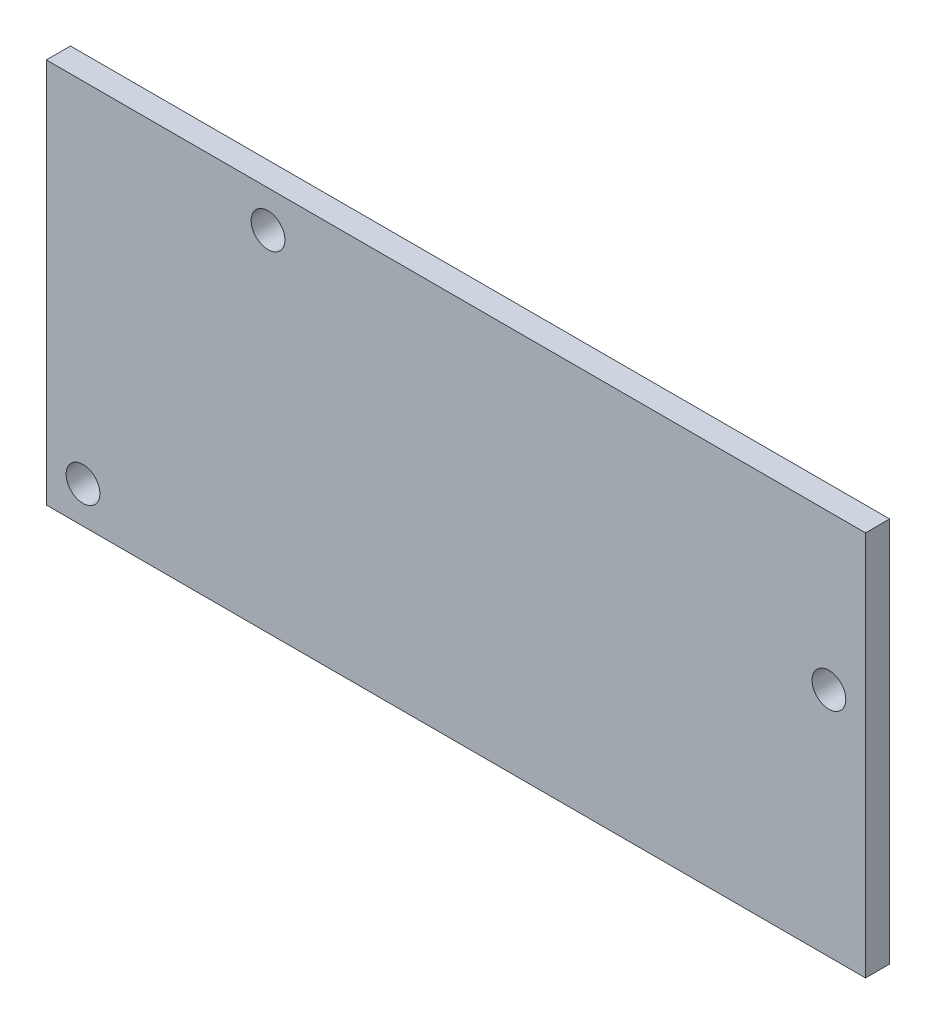
ISO-10303-21;
HEADER;
FILE_DESCRIPTION(('STEP AP214'),'2;1');
FILE_NAME('part.step','',(''),(''),'','','');
FILE_SCHEMA(('AUTOMOTIVE_DESIGN { 1 0 10303 214 1 1 1 1 }'));
ENDSEC;
DATA;
#1=APPLICATION_CONTEXT('core data for automotive mechanical design processes');
#2=APPLICATION_PROTOCOL_DEFINITION('international standard','automotive_design',2000,#1);
#3=PRODUCT_CONTEXT('',#1,'mechanical');
#4=PRODUCT('Part','Part','',(#3));
#5=PRODUCT_RELATED_PRODUCT_CATEGORY('part','',(#4));
#6=PRODUCT_DEFINITION_FORMATION('','',#4);
#7=PRODUCT_DEFINITION_CONTEXT('part definition',#1,'design');
#8=PRODUCT_DEFINITION('design','',#6,#7);
#9=PRODUCT_DEFINITION_SHAPE('','',#8);
#10=(LENGTH_UNIT() NAMED_UNIT(*) SI_UNIT(.MILLI.,.METRE.));
#11=(NAMED_UNIT(*) PLANE_ANGLE_UNIT() SI_UNIT($,.RADIAN.));
#12=(NAMED_UNIT(*) SI_UNIT($,.STERADIAN.) SOLID_ANGLE_UNIT());
#13=UNCERTAINTY_MEASURE_WITH_UNIT(LENGTH_MEASURE(1.E-05),#10,'distance_accuracy_value','');
#14=(GEOMETRIC_REPRESENTATION_CONTEXT(3) GLOBAL_UNCERTAINTY_ASSIGNED_CONTEXT((#13)) GLOBAL_UNIT_ASSIGNED_CONTEXT((#10,
#11,#12)) REPRESENTATION_CONTEXT('',''));
#15=CARTESIAN_POINT('',(0.,0.,0.));
#16=DIRECTION('',(0.,0.,1.));
#17=DIRECTION('',(1.,0.,0.));
#18=AXIS2_PLACEMENT_3D('',#15,#16,#17);
#19=CARTESIAN_POINT('',(0.,0.,0.));
#20=DIRECTION('',(0.,0.,-1.));
#21=DIRECTION('',(-1.,0.,0.));
#22=AXIS2_PLACEMENT_3D('',#19,#20,#21);
#23=PLANE('',#22);
#24=CARTESIAN_POINT('',(3.8,3.8,0.));
#25=DIRECTION('',(0.,0.,1.));
#26=DIRECTION('',(1.,0.,0.));
#27=AXIS2_PLACEMENT_3D('',#24,#25,#26);
#28=CIRCLE('',#27,1.75);
#29=CARTESIAN_POINT('',(5.55,3.8,0.));
#30=VERTEX_POINT('',#29);
#31=EDGE_CURVE('E227',#30,#30,#28,.T.);
#32=ORIENTED_EDGE('',*,*,#31,.T.);
#33=EDGE_LOOP('',(#32));
#34=FACE_BOUND('',#33,.T.);
#35=DIRECTION('',(0.,-1.,0.));
#36=VECTOR('',#35,1.);
#37=CARTESIAN_POINT('',(0.,0.,0.));
#38=LINE('',#37,#36);
#39=CARTESIAN_POINT('',(0.,40.,0.));
#40=VERTEX_POINT('',#39);
#41=CARTESIAN_POINT('',(0.,0.,0.));
#42=VERTEX_POINT('',#41);
#43=EDGE_CURVE('E152',#40,#42,#38,.T.);
#44=ORIENTED_EDGE('',*,*,#43,.F.);
#45=DIRECTION('',(-1.,0.,0.));
#46=VECTOR('',#45,1.);
#47=CARTESIAN_POINT('',(0.,40.,0.));
#48=LINE('',#47,#46);
#49=CARTESIAN_POINT('',(85.,40.,0.));
#50=VERTEX_POINT('',#49);
#51=EDGE_CURVE('E148',#50,#40,#48,.T.);
#52=ORIENTED_EDGE('',*,*,#51,.F.);
#53=DIRECTION('',(0.,1.,0.));
#54=VECTOR('',#53,1.);
#55=CARTESIAN_POINT('',(85.,0.,0.));
#56=LINE('',#55,#54);
#57=CARTESIAN_POINT('',(85.,0.,0.));
#58=VERTEX_POINT('',#57);
#59=EDGE_CURVE('E247',#58,#50,#56,.T.);
#60=ORIENTED_EDGE('',*,*,#59,.F.);
#61=DIRECTION('',(1.,0.,0.));
#62=VECTOR('',#61,1.);
#63=CARTESIAN_POINT('',(0.,0.,0.));
#64=LINE('',#63,#62);
#65=EDGE_CURVE('E245',#42,#58,#64,.T.);
#66=ORIENTED_EDGE('',*,*,#65,.F.);
#67=EDGE_LOOP('',(#44,#52,#60,#66));
#68=FACE_BOUND('',#67,.T.);
#69=CARTESIAN_POINT('',(23.,36.2,0.));
#70=DIRECTION('',(0.,0.,1.));
#71=DIRECTION('',(1.,0.,0.));
#72=AXIS2_PLACEMENT_3D('',#69,#70,#71);
#73=CIRCLE('',#72,1.75);
#74=CARTESIAN_POINT('',(24.75,36.2,0.));
#75=VERTEX_POINT('',#74);
#76=EDGE_CURVE('E233',#75,#75,#73,.T.);
#77=ORIENTED_EDGE('',*,*,#76,.T.);
#78=EDGE_LOOP('',(#77));
#79=FACE_BOUND('',#78,.T.);
#80=CARTESIAN_POINT('',(81.2,24.,0.));
#81=DIRECTION('',(0.,0.,1.));
#82=DIRECTION('',(1.,0.,0.));
#83=AXIS2_PLACEMENT_3D('',#80,#81,#82);
#84=CIRCLE('',#83,1.75);
#85=CARTESIAN_POINT('',(82.95,24.,0.));
#86=VERTEX_POINT('',#85);
#87=EDGE_CURVE('E223',#86,#86,#84,.T.);
#88=ORIENTED_EDGE('',*,*,#87,.T.);
#89=EDGE_LOOP('',(#88));
#90=FACE_BOUND('',#89,.T.);
#91=DIRECTION('',(0.,1.,0.));
#92=VECTOR('',#91,1.);
#93=CARTESIAN_POINT('',(55.,28.5,0.));
#94=LINE('',#93,#92);
#95=CARTESIAN_POINT('',(55.,9.,0.));
#96=VERTEX_POINT('',#95);
#97=CARTESIAN_POINT('',(55.,31.,0.));
#98=VERTEX_POINT('',#97);
#99=EDGE_CURVE('E203',#96,#98,#94,.T.);
#100=ORIENTED_EDGE('',*,*,#99,.F.);
#101=DIRECTION('',(-1.,0.,0.));
#102=VECTOR('',#101,1.);
#103=CARTESIAN_POINT('',(0.,9.,0.));
#104=LINE('',#103,#102);
#105=CARTESIAN_POINT('',(58.,9.,0.));
#106=VERTEX_POINT('',#105);
#107=EDGE_CURVE('E174',#96,#106,#104,.F.);
#108=ORIENTED_EDGE('',*,*,#107,.T.);
#109=DIRECTION('',(0.,-1.,0.));
#110=VECTOR('',#109,1.);
#111=CARTESIAN_POINT('',(58.,28.5,0.));
#112=LINE('',#111,#110);
#113=CARTESIAN_POINT('',(58.,31.,0.));
#114=VERTEX_POINT('',#113);
#115=EDGE_CURVE('E167',#114,#106,#112,.T.);
#116=ORIENTED_EDGE('',*,*,#115,.F.);
#117=DIRECTION('',(1.,0.,0.));
#118=VECTOR('',#117,1.);
#119=CARTESIAN_POINT('',(0.,31.,0.));
#120=LINE('',#119,#118);
#121=EDGE_CURVE('E171',#114,#98,#120,.F.);
#122=ORIENTED_EDGE('',*,*,#121,.T.);
#123=EDGE_LOOP('',(#100,#108,#116,#122));
#124=FACE_BOUND('',#123,.T.);
#125=ADVANCED_FACE('F37',(#34,#68,#79,#90,#124),#23,.T.);
#126=CARTESIAN_POINT('',(0.,0.,2.5));
#127=DIRECTION('',(0.,0.,-1.));
#128=DIRECTION('',(-1.,0.,0.));
#129=AXIS2_PLACEMENT_3D('',#126,#127,#128);
#130=PLANE('',#129);
#131=DIRECTION('',(0.,-1.,0.));
#132=VECTOR('',#131,1.);
#133=CARTESIAN_POINT('',(0.,0.,2.5));
#134=LINE('',#133,#132);
#135=CARTESIAN_POINT('',(0.,40.,2.5));
#136=VERTEX_POINT('',#135);
#137=CARTESIAN_POINT('',(0.,0.,2.5));
#138=VERTEX_POINT('',#137);
#139=EDGE_CURVE('E138',#136,#138,#134,.T.);
#140=ORIENTED_EDGE('',*,*,#139,.T.);
#141=DIRECTION('',(1.,0.,0.));
#142=VECTOR('',#141,1.);
#143=CARTESIAN_POINT('',(0.,0.,2.5));
#144=LINE('',#143,#142);
#145=CARTESIAN_POINT('',(85.,0.,2.5));
#146=VERTEX_POINT('',#145);
#147=EDGE_CURVE('E127',#138,#146,#144,.T.);
#148=ORIENTED_EDGE('',*,*,#147,.T.);
#149=DIRECTION('',(0.,1.,0.));
#150=VECTOR('',#149,1.);
#151=CARTESIAN_POINT('',(85.,0.,2.5));
#152=LINE('',#151,#150);
#153=CARTESIAN_POINT('',(85.,40.,2.5));
#154=VERTEX_POINT('',#153);
#155=EDGE_CURVE('E137',#146,#154,#152,.T.);
#156=ORIENTED_EDGE('',*,*,#155,.T.);
#157=DIRECTION('',(-1.,0.,0.));
#158=VECTOR('',#157,1.);
#159=CARTESIAN_POINT('',(0.,40.,2.5));
#160=LINE('',#159,#158);
#161=EDGE_CURVE('E144',#154,#136,#160,.T.);
#162=ORIENTED_EDGE('',*,*,#161,.T.);
#163=EDGE_LOOP('',(#140,#148,#156,#162));
#164=FACE_BOUND('',#163,.T.);
#165=CARTESIAN_POINT('',(23.,36.2,2.5));
#166=DIRECTION('',(0.,0.,1.));
#167=DIRECTION('',(1.,0.,0.));
#168=AXIS2_PLACEMENT_3D('',#165,#166,#167);
#169=CIRCLE('',#168,1.75);
#170=CARTESIAN_POINT('',(24.75,36.2,2.5));
#171=VERTEX_POINT('',#170);
#172=EDGE_CURVE('E236',#171,#171,#169,.T.);
#173=ORIENTED_EDGE('',*,*,#172,.F.);
#174=EDGE_LOOP('',(#173));
#175=FACE_BOUND('',#174,.T.);
#176=CARTESIAN_POINT('',(3.8,3.8,2.5));
#177=DIRECTION('',(0.,0.,1.));
#178=DIRECTION('',(1.,0.,0.));
#179=AXIS2_PLACEMENT_3D('',#176,#177,#178);
#180=CIRCLE('',#179,1.75);
#181=CARTESIAN_POINT('',(5.55,3.8,2.5));
#182=VERTEX_POINT('',#181);
#183=EDGE_CURVE('E230',#182,#182,#180,.T.);
#184=ORIENTED_EDGE('',*,*,#183,.F.);
#185=EDGE_LOOP('',(#184));
#186=FACE_BOUND('',#185,.T.);
#187=CARTESIAN_POINT('',(81.2,24.,2.5));
#188=DIRECTION('',(0.,0.,1.));
#189=DIRECTION('',(1.,0.,0.));
#190=AXIS2_PLACEMENT_3D('',#187,#188,#189);
#191=CIRCLE('',#190,1.75);
#192=CARTESIAN_POINT('',(82.95,24.,2.5));
#193=VERTEX_POINT('',#192);
#194=EDGE_CURVE('E224',#193,#193,#191,.T.);
#195=ORIENTED_EDGE('',*,*,#194,.F.);
#196=EDGE_LOOP('',(#195));
#197=FACE_BOUND('',#196,.T.);
#198=ADVANCED_FACE('F141',(#164,#175,#186,#197),#130,.F.);
#199=CARTESIAN_POINT('',(0.,0.,2.5));
#200=DIRECTION('',(1.,0.,0.));
#201=DIRECTION('',(0.,0.,-1.));
#202=AXIS2_PLACEMENT_3D('',#199,#200,#201);
#203=PLANE('',#202);
#204=ORIENTED_EDGE('',*,*,#43,.T.);
#205=DIRECTION('',(0.,0.,-1.));
#206=VECTOR('',#205,1.);
#207=CARTESIAN_POINT('',(0.,0.,2.5));
#208=LINE('',#207,#206);
#209=EDGE_CURVE('E131',#138,#42,#208,.T.);
#210=ORIENTED_EDGE('',*,*,#209,.F.);
#211=ORIENTED_EDGE('',*,*,#139,.F.);
#212=DIRECTION('',(0.,0.,-1.));
#213=VECTOR('',#212,1.);
#214=CARTESIAN_POINT('',(0.,40.,2.5));
#215=LINE('',#214,#213);
#216=EDGE_CURVE('E243',#136,#40,#215,.T.);
#217=ORIENTED_EDGE('',*,*,#216,.T.);
#218=EDGE_LOOP('',(#204,#210,#211,#217));
#219=FACE_BOUND('',#218,.T.);
#220=ADVANCED_FACE('F150',(#219),#203,.F.);
#221=CARTESIAN_POINT('',(0.,0.,2.5));
#222=DIRECTION('',(0.,1.,0.));
#223=DIRECTION('',(0.,0.,1.));
#224=AXIS2_PLACEMENT_3D('',#221,#222,#223);
#225=PLANE('',#224);
#226=ORIENTED_EDGE('',*,*,#65,.T.);
#227=DIRECTION('',(0.,0.,-1.));
#228=VECTOR('',#227,1.);
#229=CARTESIAN_POINT('',(85.,0.,2.5));
#230=LINE('',#229,#228);
#231=EDGE_CURVE('E134',#146,#58,#230,.T.);
#232=ORIENTED_EDGE('',*,*,#231,.F.);
#233=ORIENTED_EDGE('',*,*,#147,.F.);
#234=ORIENTED_EDGE('',*,*,#209,.T.);
#235=EDGE_LOOP('',(#226,#232,#233,#234));
#236=FACE_BOUND('',#235,.T.);
#237=ADVANCED_FACE('F129',(#236),#225,.F.);
#238=CARTESIAN_POINT('',(85.,0.,2.5));
#239=DIRECTION('',(-1.,0.,0.));
#240=DIRECTION('',(0.,0.,1.));
#241=AXIS2_PLACEMENT_3D('',#238,#239,#240);
#242=PLANE('',#241);
#243=ORIENTED_EDGE('',*,*,#59,.T.);
#244=DIRECTION('',(0.,0.,-1.));
#245=VECTOR('',#244,1.);
#246=CARTESIAN_POINT('',(85.,40.,2.5));
#247=LINE('',#246,#245);
#248=EDGE_CURVE('E157',#154,#50,#247,.T.);
#249=ORIENTED_EDGE('',*,*,#248,.F.);
#250=ORIENTED_EDGE('',*,*,#155,.F.);
#251=ORIENTED_EDGE('',*,*,#231,.T.);
#252=EDGE_LOOP('',(#243,#249,#250,#251));
#253=FACE_BOUND('',#252,.T.);
#254=ADVANCED_FACE('F259',(#253),#242,.F.);
#255=CARTESIAN_POINT('',(0.,40.,2.5));
#256=DIRECTION('',(0.,-1.,0.));
#257=DIRECTION('',(0.,0.,-1.));
#258=AXIS2_PLACEMENT_3D('',#255,#256,#257);
#259=PLANE('',#258);
#260=ORIENTED_EDGE('',*,*,#51,.T.);
#261=ORIENTED_EDGE('',*,*,#216,.F.);
#262=ORIENTED_EDGE('',*,*,#161,.F.);
#263=ORIENTED_EDGE('',*,*,#248,.T.);
#264=EDGE_LOOP('',(#260,#261,#262,#263));
#265=FACE_BOUND('',#264,.T.);
#266=ADVANCED_FACE('F254',(#265),#259,.F.);
#267=CARTESIAN_POINT('',(23.,36.2,2.5));
#268=DIRECTION('',(0.,0.,-1.));
#269=DIRECTION('',(-1.,0.,0.));
#270=AXIS2_PLACEMENT_3D('',#267,#268,#269);
#271=CYLINDRICAL_SURFACE('',#270,1.75);
#272=ORIENTED_EDGE('',*,*,#172,.T.);
#273=EDGE_LOOP('',(#272));
#274=FACE_BOUND('',#273,.T.);
#275=ORIENTED_EDGE('',*,*,#76,.F.);
#276=EDGE_LOOP('',(#275));
#277=FACE_BOUND('',#276,.T.);
#278=ADVANCED_FACE('F266',(#274,#277),#271,.F.);
#279=CARTESIAN_POINT('',(3.8,3.8,2.5));
#280=DIRECTION('',(0.,0.,-1.));
#281=DIRECTION('',(-1.,0.,0.));
#282=AXIS2_PLACEMENT_3D('',#279,#280,#281);
#283=CYLINDRICAL_SURFACE('',#282,1.75);
#284=ORIENTED_EDGE('',*,*,#183,.T.);
#285=EDGE_LOOP('',(#284));
#286=FACE_BOUND('',#285,.T.);
#287=ORIENTED_EDGE('',*,*,#31,.F.);
#288=EDGE_LOOP('',(#287));
#289=FACE_BOUND('',#288,.T.);
#290=ADVANCED_FACE('F279',(#286,#289),#283,.F.);
#291=CARTESIAN_POINT('',(81.2,24.,2.5));
#292=DIRECTION('',(0.,0.,-1.));
#293=DIRECTION('',(-1.,0.,0.));
#294=AXIS2_PLACEMENT_3D('',#291,#292,#293);
#295=CYLINDRICAL_SURFACE('',#294,1.75);
#296=ORIENTED_EDGE('',*,*,#194,.T.);
#297=EDGE_LOOP('',(#296));
#298=FACE_BOUND('',#297,.T.);
#299=ORIENTED_EDGE('',*,*,#87,.F.);
#300=EDGE_LOOP('',(#299));
#301=FACE_BOUND('',#300,.T.);
#302=ADVANCED_FACE('F283',(#298,#301),#295,.F.);
#303=CARTESIAN_POINT('',(58.,28.5,-12.));
#304=DIRECTION('',(-1.,0.,0.));
#305=DIRECTION('',(0.,0.,1.));
#306=AXIS2_PLACEMENT_3D('',#303,#304,#305);
#307=PLANE('',#306);
#308=CARTESIAN_POINT('',(58.,24.25,-8.5));
#309=DIRECTION('',(1.,0.,0.));
#310=DIRECTION('',(0.,0.,-1.));
#311=AXIS2_PLACEMENT_3D('',#308,#309,#310);
#312=CIRCLE('',#311,1.75);
#313=CARTESIAN_POINT('',(58.,24.25,-10.25));
#314=VERTEX_POINT('',#313);
#315=EDGE_CURVE('E165',#314,#314,#312,.T.);
#316=ORIENTED_EDGE('',*,*,#315,.F.);
#317=EDGE_LOOP('',(#316));
#318=FACE_BOUND('',#317,.T.);
#319=CARTESIAN_POINT('',(58.,15.75,-8.5));
#320=DIRECTION('',(1.,0.,0.));
#321=DIRECTION('',(0.,0.,-1.));
#322=AXIS2_PLACEMENT_3D('',#319,#320,#321);
#323=CIRCLE('',#322,1.75);
#324=CARTESIAN_POINT('',(58.,15.75,-10.25));
#325=VERTEX_POINT('',#324);
#326=EDGE_CURVE('E337',#325,#325,#323,.T.);
#327=ORIENTED_EDGE('',*,*,#326,.F.);
#328=EDGE_LOOP('',(#327));
#329=FACE_BOUND('',#328,.T.);
#330=DIRECTION('',(0.,0.,1.));
#331=VECTOR('',#330,1.);
#332=CARTESIAN_POINT('',(58.,11.5,-12.));
#333=LINE('',#332,#331);
#334=CARTESIAN_POINT('',(58.,11.5,-9.5));
#335=VERTEX_POINT('',#334);
#336=CARTESIAN_POINT('',(58.,11.5,-2.5));
#337=VERTEX_POINT('',#336);
#338=EDGE_CURVE('E220',#335,#337,#333,.T.);
#339=ORIENTED_EDGE('',*,*,#338,.F.);
#340=CARTESIAN_POINT('',(58.,14.,-9.5));
#341=DIRECTION('',(-1.,0.,0.));
#342=DIRECTION('',(0.,0.,1.));
#343=AXIS2_PLACEMENT_3D('',#340,#341,#342);
#344=CIRCLE('',#343,2.5);
#345=CARTESIAN_POINT('',(58.,14.,-12.));
#346=VERTEX_POINT('',#345);
#347=EDGE_CURVE('E188',#335,#346,#344,.F.);
#348=ORIENTED_EDGE('',*,*,#347,.T.);
#349=DIRECTION('',(0.,-1.,0.));
#350=VECTOR('',#349,1.);
#351=CARTESIAN_POINT('',(58.,28.5,-12.));
#352=LINE('',#351,#350);
#353=CARTESIAN_POINT('',(58.,26.,-12.));
#354=VERTEX_POINT('',#353);
#355=EDGE_CURVE('E207',#354,#346,#352,.T.);
#356=ORIENTED_EDGE('',*,*,#355,.F.);
#357=CARTESIAN_POINT('',(58.,26.,-9.5));
#358=DIRECTION('',(-1.,0.,0.));
#359=DIRECTION('',(0.,0.,1.));
#360=AXIS2_PLACEMENT_3D('',#357,#358,#359);
#361=CIRCLE('',#360,2.5);
#362=CARTESIAN_POINT('',(58.,28.5,-9.5));
#363=VERTEX_POINT('',#362);
#364=EDGE_CURVE('E59',#354,#363,#361,.F.);
#365=ORIENTED_EDGE('',*,*,#364,.T.);
#366=DIRECTION('',(0.,0.,1.));
#367=VECTOR('',#366,1.);
#368=CARTESIAN_POINT('',(58.,28.5,-12.));
#369=LINE('',#368,#367);
#370=CARTESIAN_POINT('',(58.,28.5,-2.5));
#371=VERTEX_POINT('',#370);
#372=EDGE_CURVE('E200',#363,#371,#369,.T.);
#373=ORIENTED_EDGE('',*,*,#372,.T.);
#374=CARTESIAN_POINT('',(58.,31.,-2.5));
#375=DIRECTION('',(-1.,0.,0.));
#376=DIRECTION('',(0.,0.,1.));
#377=AXIS2_PLACEMENT_3D('',#374,#375,#376);
#378=CIRCLE('',#377,2.5);
#379=EDGE_CURVE('E45',#371,#114,#378,.T.);
#380=ORIENTED_EDGE('',*,*,#379,.T.);
#381=ORIENTED_EDGE('',*,*,#115,.T.);
#382=CARTESIAN_POINT('',(58.,9.,-2.5));
#383=DIRECTION('',(-1.,0.,0.));
#384=DIRECTION('',(0.,0.,1.));
#385=AXIS2_PLACEMENT_3D('',#382,#383,#384);
#386=CIRCLE('',#385,2.5);
#387=EDGE_CURVE('E197',#106,#337,#386,.T.);
#388=ORIENTED_EDGE('',*,*,#387,.T.);
#389=EDGE_LOOP('',(#339,#348,#356,#365,#373,#380,#381,#388));
#390=FACE_BOUND('',#389,.T.);
#391=ADVANCED_FACE('F199',(#318,#329,#390),#307,.F.);
#392=CARTESIAN_POINT('',(58.,11.5,-12.));
#393=DIRECTION('',(0.,1.,0.));
#394=DIRECTION('',(0.,0.,1.));
#395=AXIS2_PLACEMENT_3D('',#392,#393,#394);
#396=PLANE('',#395);
#397=ORIENTED_EDGE('',*,*,#338,.T.);
#398=DIRECTION('',(-1.,0.,0.));
#399=VECTOR('',#398,1.);
#400=CARTESIAN_POINT('',(58.,11.5,-2.5));
#401=LINE('',#400,#399);
#402=CARTESIAN_POINT('',(55.,11.5,-2.5));
#403=VERTEX_POINT('',#402);
#404=EDGE_CURVE('E155',#337,#403,#401,.T.);
#405=ORIENTED_EDGE('',*,*,#404,.T.);
#406=DIRECTION('',(0.,0.,1.));
#407=VECTOR('',#406,1.);
#408=CARTESIAN_POINT('',(55.,11.5,-12.));
#409=LINE('',#408,#407);
#410=CARTESIAN_POINT('',(55.,11.5,-9.5));
#411=VERTEX_POINT('',#410);
#412=EDGE_CURVE('E217',#411,#403,#409,.T.);
#413=ORIENTED_EDGE('',*,*,#412,.F.);
#414=DIRECTION('',(-1.,0.,0.));
#415=VECTOR('',#414,1.);
#416=CARTESIAN_POINT('',(58.,11.5,-9.5));
#417=LINE('',#416,#415);
#418=EDGE_CURVE('E153',#411,#335,#417,.F.);
#419=ORIENTED_EDGE('',*,*,#418,.T.);
#420=EDGE_LOOP('',(#397,#405,#413,#419));
#421=FACE_BOUND('',#420,.T.);
#422=ADVANCED_FACE('F290',(#421),#396,.F.);
#423=CARTESIAN_POINT('',(55.,28.5,-12.));
#424=DIRECTION('',(1.,0.,0.));
#425=DIRECTION('',(0.,0.,-1.));
#426=AXIS2_PLACEMENT_3D('',#423,#424,#425);
#427=PLANE('',#426);
#428=CARTESIAN_POINT('',(55.,24.25,-8.5));
#429=DIRECTION('',(1.,0.,0.));
#430=DIRECTION('',(0.,0.,-1.));
#431=AXIS2_PLACEMENT_3D('',#428,#429,#430);
#432=CIRCLE('',#431,1.75);
#433=CARTESIAN_POINT('',(55.,24.25,-10.25));
#434=VERTEX_POINT('',#433);
#435=EDGE_CURVE('E164',#434,#434,#432,.T.);
#436=ORIENTED_EDGE('',*,*,#435,.T.);
#437=EDGE_LOOP('',(#436));
#438=FACE_BOUND('',#437,.T.);
#439=CARTESIAN_POINT('',(55.,15.75,-8.5));
#440=DIRECTION('',(1.,0.,0.));
#441=DIRECTION('',(0.,0.,-1.));
#442=AXIS2_PLACEMENT_3D('',#439,#440,#441);
#443=CIRCLE('',#442,1.75);
#444=CARTESIAN_POINT('',(55.,15.75,-10.25));
#445=VERTEX_POINT('',#444);
#446=EDGE_CURVE('E161',#445,#445,#443,.T.);
#447=ORIENTED_EDGE('',*,*,#446,.T.);
#448=EDGE_LOOP('',(#447));
#449=FACE_BOUND('',#448,.T.);
#450=DIRECTION('',(0.,1.,0.));
#451=VECTOR('',#450,1.);
#452=CARTESIAN_POINT('',(55.,28.5,-12.));
#453=LINE('',#452,#451);
#454=CARTESIAN_POINT('',(55.,14.,-12.));
#455=VERTEX_POINT('',#454);
#456=CARTESIAN_POINT('',(55.,26.,-12.));
#457=VERTEX_POINT('',#456);
#458=EDGE_CURVE('E210',#455,#457,#453,.T.);
#459=ORIENTED_EDGE('',*,*,#458,.F.);
#460=CARTESIAN_POINT('',(55.,14.,-9.5));
#461=DIRECTION('',(1.,0.,0.));
#462=DIRECTION('',(0.,0.,-1.));
#463=AXIS2_PLACEMENT_3D('',#460,#461,#462);
#464=CIRCLE('',#463,2.5);
#465=EDGE_CURVE('E185',#455,#411,#464,.F.);
#466=ORIENTED_EDGE('',*,*,#465,.T.);
#467=ORIENTED_EDGE('',*,*,#412,.T.);
#468=CARTESIAN_POINT('',(55.,9.,-2.5));
#469=DIRECTION('',(1.,0.,0.));
#470=DIRECTION('',(0.,0.,-1.));
#471=AXIS2_PLACEMENT_3D('',#468,#469,#470);
#472=CIRCLE('',#471,2.5);
#473=EDGE_CURVE('E194',#403,#96,#472,.T.);
#474=ORIENTED_EDGE('',*,*,#473,.T.);
#475=ORIENTED_EDGE('',*,*,#99,.T.);
#476=CARTESIAN_POINT('',(55.,31.,-2.5));
#477=DIRECTION('',(1.,0.,0.));
#478=DIRECTION('',(0.,0.,-1.));
#479=AXIS2_PLACEMENT_3D('',#476,#477,#478);
#480=CIRCLE('',#479,2.5);
#481=CARTESIAN_POINT('',(55.,28.5,-2.5));
#482=VERTEX_POINT('',#481);
#483=EDGE_CURVE('E11',#98,#482,#480,.T.);
#484=ORIENTED_EDGE('',*,*,#483,.T.);
#485=DIRECTION('',(0.,0.,1.));
#486=VECTOR('',#485,1.);
#487=CARTESIAN_POINT('',(55.,28.5,-12.));
#488=LINE('',#487,#486);
#489=CARTESIAN_POINT('',(55.,28.5,-9.5));
#490=VERTEX_POINT('',#489);
#491=EDGE_CURVE('E214',#490,#482,#488,.T.);
#492=ORIENTED_EDGE('',*,*,#491,.F.);
#493=CARTESIAN_POINT('',(55.,26.,-9.5));
#494=DIRECTION('',(1.,0.,0.));
#495=DIRECTION('',(0.,0.,-1.));
#496=AXIS2_PLACEMENT_3D('',#493,#494,#495);
#497=CIRCLE('',#496,2.5);
#498=EDGE_CURVE('E183',#490,#457,#497,.F.);
#499=ORIENTED_EDGE('',*,*,#498,.T.);
#500=EDGE_LOOP('',(#459,#466,#467,#474,#475,#484,#492,#499));
#501=FACE_BOUND('',#500,.T.);
#502=ADVANCED_FACE('F294',(#438,#449,#501),#427,.F.);
#503=CARTESIAN_POINT('',(58.,28.5,-12.));
#504=DIRECTION('',(0.,-1.,0.));
#505=DIRECTION('',(0.,0.,-1.));
#506=AXIS2_PLACEMENT_3D('',#503,#504,#505);
#507=PLANE('',#506);
#508=ORIENTED_EDGE('',*,*,#372,.F.);
#509=DIRECTION('',(1.,0.,0.));
#510=VECTOR('',#509,1.);
#511=CARTESIAN_POINT('',(55.,28.5,-9.5));
#512=LINE('',#511,#510);
#513=EDGE_CURVE('E192',#363,#490,#512,.F.);
#514=ORIENTED_EDGE('',*,*,#513,.T.);
#515=ORIENTED_EDGE('',*,*,#491,.T.);
#516=DIRECTION('',(1.,0.,0.));
#517=VECTOR('',#516,1.);
#518=CARTESIAN_POINT('',(58.,28.5,-2.5));
#519=LINE('',#518,#517);
#520=EDGE_CURVE('E190',#482,#371,#519,.T.);
#521=ORIENTED_EDGE('',*,*,#520,.T.);
#522=EDGE_LOOP('',(#508,#514,#515,#521));
#523=FACE_BOUND('',#522,.T.);
#524=ADVANCED_FACE('F298',(#523),#507,.F.);
#525=CARTESIAN_POINT('',(0.,0.,-12.));
#526=DIRECTION('',(0.,0.,-1.));
#527=DIRECTION('',(-1.,0.,0.));
#528=AXIS2_PLACEMENT_3D('',#525,#526,#527);
#529=PLANE('',#528);
#530=ORIENTED_EDGE('',*,*,#355,.T.);
#531=DIRECTION('',(-1.,0.,0.));
#532=VECTOR('',#531,1.);
#533=CARTESIAN_POINT('',(55.,14.,-12.));
#534=LINE('',#533,#532);
#535=EDGE_CURVE('E180',#346,#455,#534,.T.);
#536=ORIENTED_EDGE('',*,*,#535,.T.);
#537=ORIENTED_EDGE('',*,*,#458,.T.);
#538=DIRECTION('',(1.,0.,0.));
#539=VECTOR('',#538,1.);
#540=CARTESIAN_POINT('',(58.,26.,-12.));
#541=LINE('',#540,#539);
#542=EDGE_CURVE('E177',#457,#354,#541,.T.);
#543=ORIENTED_EDGE('',*,*,#542,.T.);
#544=EDGE_LOOP('',(#530,#536,#537,#543));
#545=FACE_BOUND('',#544,.T.);
#546=ADVANCED_FACE('F302',(#545),#529,.T.);
#547=CARTESIAN_POINT('',(0.,15.75,-8.5));
#548=DIRECTION('',(1.,0.,0.));
#549=DIRECTION('',(0.,0.,-1.));
#550=AXIS2_PLACEMENT_3D('',#547,#548,#549);
#551=CYLINDRICAL_SURFACE('',#550,1.75);
#552=ORIENTED_EDGE('',*,*,#326,.T.);
#553=EDGE_LOOP('',(#552));
#554=FACE_BOUND('',#553,.T.);
#555=ORIENTED_EDGE('',*,*,#446,.F.);
#556=EDGE_LOOP('',(#555));
#557=FACE_BOUND('',#556,.T.);
#558=ADVANCED_FACE('F306',(#554,#557),#551,.F.);
#559=CARTESIAN_POINT('',(0.,24.25,-8.5));
#560=DIRECTION('',(1.,0.,0.));
#561=DIRECTION('',(0.,0.,-1.));
#562=AXIS2_PLACEMENT_3D('',#559,#560,#561);
#563=CYLINDRICAL_SURFACE('',#562,1.75);
#564=ORIENTED_EDGE('',*,*,#315,.T.);
#565=EDGE_LOOP('',(#564));
#566=FACE_BOUND('',#565,.T.);
#567=ORIENTED_EDGE('',*,*,#435,.F.);
#568=EDGE_LOOP('',(#567));
#569=FACE_BOUND('',#568,.T.);
#570=ADVANCED_FACE('F310',(#566,#569),#563,.F.);
#571=CARTESIAN_POINT('',(58.,9.,-2.5));
#572=DIRECTION('',(-1.,0.,0.));
#573=DIRECTION('',(0.,0.,1.));
#574=AXIS2_PLACEMENT_3D('',#571,#572,#573);
#575=CYLINDRICAL_SURFACE('',#574,2.5);
#576=ORIENTED_EDGE('',*,*,#387,.F.);
#577=ORIENTED_EDGE('',*,*,#107,.F.);
#578=ORIENTED_EDGE('',*,*,#473,.F.);
#579=ORIENTED_EDGE('',*,*,#404,.F.);
#580=EDGE_LOOP('',(#576,#577,#578,#579));
#581=FACE_BOUND('',#580,.T.);
#582=ADVANCED_FACE('F313',(#581),#575,.F.);
#583=CARTESIAN_POINT('',(0.,14.,-9.5));
#584=DIRECTION('',(1.,0.,0.));
#585=DIRECTION('',(0.,0.,-1.));
#586=AXIS2_PLACEMENT_3D('',#583,#584,#585);
#587=CYLINDRICAL_SURFACE('',#586,2.5);
#588=ORIENTED_EDGE('',*,*,#347,.F.);
#589=ORIENTED_EDGE('',*,*,#418,.F.);
#590=ORIENTED_EDGE('',*,*,#465,.F.);
#591=ORIENTED_EDGE('',*,*,#535,.F.);
#592=EDGE_LOOP('',(#588,#589,#590,#591));
#593=FACE_BOUND('',#592,.T.);
#594=ADVANCED_FACE('F318',(#593),#587,.T.);
#595=CARTESIAN_POINT('',(0.,26.,-9.5));
#596=DIRECTION('',(-1.,0.,0.));
#597=DIRECTION('',(0.,0.,1.));
#598=AXIS2_PLACEMENT_3D('',#595,#596,#597);
#599=CYLINDRICAL_SURFACE('',#598,2.5);
#600=ORIENTED_EDGE('',*,*,#498,.F.);
#601=ORIENTED_EDGE('',*,*,#513,.F.);
#602=ORIENTED_EDGE('',*,*,#364,.F.);
#603=ORIENTED_EDGE('',*,*,#542,.F.);
#604=EDGE_LOOP('',(#600,#601,#602,#603));
#605=FACE_BOUND('',#604,.T.);
#606=ADVANCED_FACE('F349',(#605),#599,.T.);
#607=CARTESIAN_POINT('',(58.,31.,-2.5));
#608=DIRECTION('',(1.,0.,0.));
#609=DIRECTION('',(0.,0.,-1.));
#610=AXIS2_PLACEMENT_3D('',#607,#608,#609);
#611=CYLINDRICAL_SURFACE('',#610,2.5);
#612=ORIENTED_EDGE('',*,*,#483,.F.);
#613=ORIENTED_EDGE('',*,*,#121,.F.);
#614=ORIENTED_EDGE('',*,*,#379,.F.);
#615=ORIENTED_EDGE('',*,*,#520,.F.);
#616=EDGE_LOOP('',(#612,#613,#614,#615));
#617=FACE_BOUND('',#616,.T.);
#618=ADVANCED_FACE('F39',(#617),#611,.F.);
#619=CLOSED_SHELL('',(#125,#198,#220,#237,#254,#266,#278,#290,#302,#391,#422,#502,#524,#546,
#558,#570,#582,#594,#606,#618));
#620=MANIFOLD_SOLID_BREP('B2',#619);
#621=ADVANCED_BREP_SHAPE_REPRESENTATION('',(#18,#620),#14);
#622=SHAPE_DEFINITION_REPRESENTATION(#9,#621);
ENDSEC;
END-ISO-10303-21;
